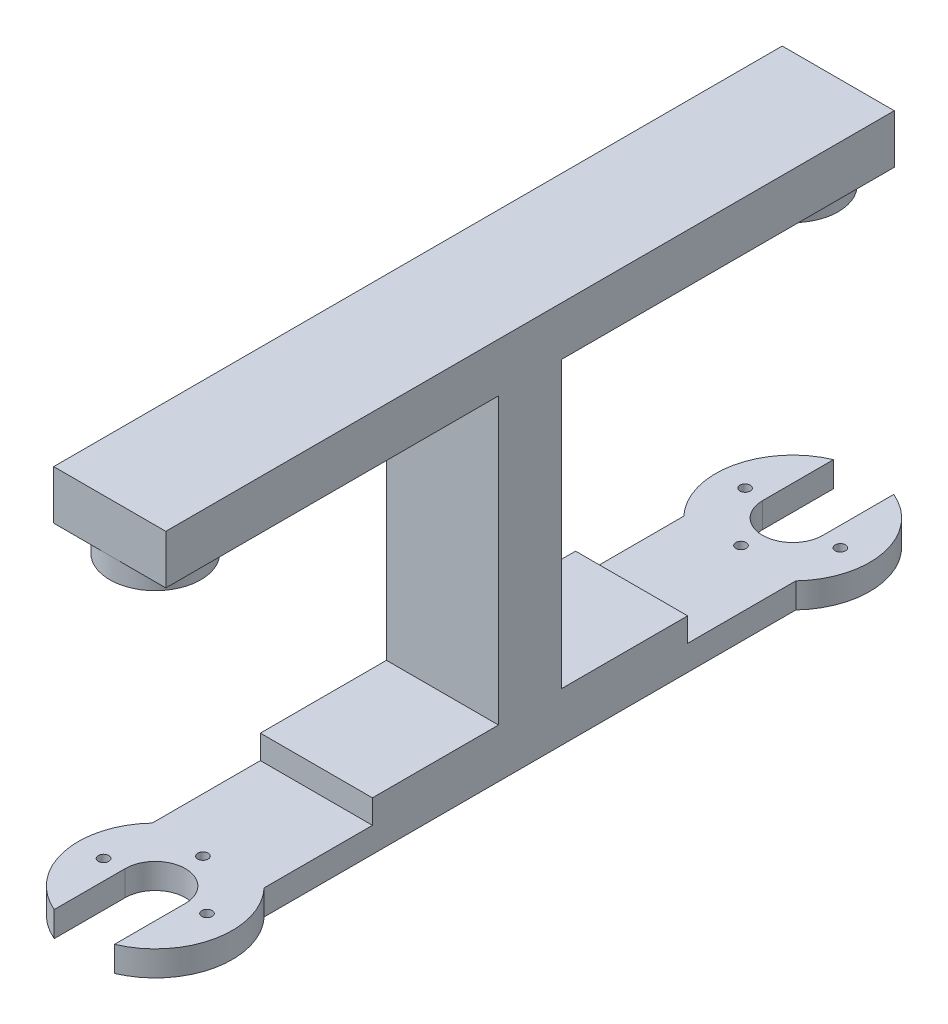
ISO-10303-21;
HEADER;
FILE_DESCRIPTION(('STEP AP214'),'2;1');
FILE_NAME('part.step','',(''),(''),'','','');
FILE_SCHEMA(('AUTOMOTIVE_DESIGN { 1 0 10303 214 1 1 1 1 }'));
ENDSEC;
DATA;
#1=APPLICATION_CONTEXT('core data for automotive mechanical design processes');
#2=APPLICATION_PROTOCOL_DEFINITION('international standard','automotive_design',2000,#1);
#3=PRODUCT_CONTEXT('',#1,'mechanical');
#4=PRODUCT('Part','Part','',(#3));
#5=PRODUCT_RELATED_PRODUCT_CATEGORY('part','',(#4));
#6=PRODUCT_DEFINITION_FORMATION('','',#4);
#7=PRODUCT_DEFINITION_CONTEXT('part definition',#1,'design');
#8=PRODUCT_DEFINITION('design','',#6,#7);
#9=PRODUCT_DEFINITION_SHAPE('','',#8);
#10=(LENGTH_UNIT() NAMED_UNIT(*) SI_UNIT(.MILLI.,.METRE.));
#11=(NAMED_UNIT(*) PLANE_ANGLE_UNIT() SI_UNIT($,.RADIAN.));
#12=(NAMED_UNIT(*) SI_UNIT($,.STERADIAN.) SOLID_ANGLE_UNIT());
#13=UNCERTAINTY_MEASURE_WITH_UNIT(LENGTH_MEASURE(1.E-05),#10,'distance_accuracy_value','');
#14=(GEOMETRIC_REPRESENTATION_CONTEXT(3) GLOBAL_UNCERTAINTY_ASSIGNED_CONTEXT((#13)) GLOBAL_UNIT_ASSIGNED_CONTEXT((#10,
#11,#12)) REPRESENTATION_CONTEXT('',''));
#15=CARTESIAN_POINT('',(0.,0.,0.));
#16=DIRECTION('',(0.,0.,1.));
#17=DIRECTION('',(1.,0.,0.));
#18=AXIS2_PLACEMENT_3D('',#15,#16,#17);
#19=CARTESIAN_POINT('',(16.,0.,0.));
#20=DIRECTION('',(-1.,0.,0.));
#21=DIRECTION('',(0.,0.,1.));
#22=AXIS2_PLACEMENT_3D('',#19,#20,#21);
#23=PLANE('',#22);
#24=DIRECTION('',(0.,-1.,0.));
#25=VECTOR('',#24,1.);
#26=CARTESIAN_POINT('',(16.,0.,-74.5));
#27=LINE('',#26,#25);
#28=CARTESIAN_POINT('',(16.,-37.7,-74.5));
#29=VERTEX_POINT('',#28);
#30=CARTESIAN_POINT('',(16.,-41.1,-74.5));
#31=VERTEX_POINT('',#30);
#32=EDGE_CURVE('E835',#29,#31,#27,.T.);
#33=ORIENTED_EDGE('',*,*,#32,.F.);
#34=DIRECTION('',(0.,0.,-1.));
#35=VECTOR('',#34,1.);
#36=CARTESIAN_POINT('',(16.,-37.7,-56.5));
#37=LINE('',#36,#35);
#38=CARTESIAN_POINT('',(16.,-37.7,-56.5));
#39=VERTEX_POINT('',#38);
#40=EDGE_CURVE('E630',#39,#29,#37,.T.);
#41=ORIENTED_EDGE('',*,*,#40,.F.);
#42=DIRECTION('',(0.,-1.,0.));
#43=VECTOR('',#42,1.);
#44=CARTESIAN_POINT('',(16.,3.,-56.5));
#45=LINE('',#44,#43);
#46=CARTESIAN_POINT('',(16.,3.,-56.5));
#47=VERTEX_POINT('',#46);
#48=EDGE_CURVE('E634',#47,#39,#45,.T.);
#49=ORIENTED_EDGE('',*,*,#48,.F.);
#50=DIRECTION('',(0.,0.,1.));
#51=VECTOR('',#50,1.);
#52=CARTESIAN_POINT('',(16.,3.,-91.));
#53=LINE('',#52,#51);
#54=CARTESIAN_POINT('',(16.,3.,-104.));
#55=VERTEX_POINT('',#54);
#56=EDGE_CURVE('E637',#55,#47,#53,.T.);
#57=ORIENTED_EDGE('',*,*,#56,.F.);
#58=DIRECTION('',(0.,-1.,0.));
#59=VECTOR('',#58,1.);
#60=CARTESIAN_POINT('',(16.,0.,-104.));
#61=LINE('',#60,#59);
#62=CARTESIAN_POINT('',(16.,10.,-104.));
#63=VERTEX_POINT('',#62);
#64=EDGE_CURVE('E627',#63,#55,#61,.T.);
#65=ORIENTED_EDGE('',*,*,#64,.F.);
#66=DIRECTION('',(0.,0.,1.));
#67=VECTOR('',#66,1.);
#68=CARTESIAN_POINT('',(16.,10.,0.));
#69=LINE('',#68,#67);
#70=CARTESIAN_POINT('',(16.,10.,0.));
#71=VERTEX_POINT('',#70);
#72=EDGE_CURVE('E476',#63,#71,#69,.T.);
#73=ORIENTED_EDGE('',*,*,#72,.T.);
#74=DIRECTION('',(0.,-1.,0.));
#75=VECTOR('',#74,1.);
#76=CARTESIAN_POINT('',(16.,0.,0.));
#77=LINE('',#76,#75);
#78=CARTESIAN_POINT('',(16.,3.,0.));
#79=VERTEX_POINT('',#78);
#80=EDGE_CURVE('E481',#71,#79,#77,.T.);
#81=ORIENTED_EDGE('',*,*,#80,.T.);
#82=DIRECTION('',(0.,0.,-1.));
#83=VECTOR('',#82,1.);
#84=CARTESIAN_POINT('',(16.,3.,-13.));
#85=LINE('',#84,#83);
#86=CARTESIAN_POINT('',(16.,3.,-47.5));
#87=VERTEX_POINT('',#86);
#88=EDGE_CURVE('E503',#79,#87,#85,.T.);
#89=ORIENTED_EDGE('',*,*,#88,.T.);
#90=DIRECTION('',(0.,-1.,0.));
#91=VECTOR('',#90,1.);
#92=CARTESIAN_POINT('',(16.,3.,-47.5));
#93=LINE('',#92,#91);
#94=CARTESIAN_POINT('',(16.,-37.7,-47.5));
#95=VERTEX_POINT('',#94);
#96=EDGE_CURVE('E501',#87,#95,#93,.T.);
#97=ORIENTED_EDGE('',*,*,#96,.T.);
#98=DIRECTION('',(0.,0.,1.));
#99=VECTOR('',#98,1.);
#100=CARTESIAN_POINT('',(16.,-37.7,-47.5));
#101=LINE('',#100,#99);
#102=CARTESIAN_POINT('',(16.,-37.7,-29.5));
#103=VERTEX_POINT('',#102);
#104=EDGE_CURVE('E498',#95,#103,#101,.T.);
#105=ORIENTED_EDGE('',*,*,#104,.T.);
#106=DIRECTION('',(0.,-1.,0.));
#107=VECTOR('',#106,1.);
#108=CARTESIAN_POINT('',(16.,0.,-29.5));
#109=LINE('',#108,#107);
#110=CARTESIAN_POINT('',(16.,-41.1,-29.5));
#111=VERTEX_POINT('',#110);
#112=EDGE_CURVE('E590',#103,#111,#109,.T.);
#113=ORIENTED_EDGE('',*,*,#112,.T.);
#114=DIRECTION('',(0.,0.,-1.));
#115=VECTOR('',#114,1.);
#116=CARTESIAN_POINT('',(16.,-41.1,0.));
#117=LINE('',#116,#115);
#118=CARTESIAN_POINT('',(16.,-41.1,-14.0498344352708));
#119=VERTEX_POINT('',#118);
#120=EDGE_CURVE('E540',#119,#111,#117,.T.);
#121=ORIENTED_EDGE('',*,*,#120,.F.);
#122=DIRECTION('',(0.,-1.,0.));
#123=VECTOR('',#122,1.);
#124=CARTESIAN_POINT('',(16.,-37.7,-14.0498344352708));
#125=LINE('',#124,#123);
#126=CARTESIAN_POINT('',(16.,-44.7,-14.0498344352708));
#127=VERTEX_POINT('',#126);
#128=EDGE_CURVE('E517',#127,#119,#125,.F.);
#129=ORIENTED_EDGE('',*,*,#128,.F.);
#130=DIRECTION('',(0.,0.,-1.));
#131=VECTOR('',#130,1.);
#132=CARTESIAN_POINT('',(16.,-44.7,0.));
#133=LINE('',#132,#131);
#134=CARTESIAN_POINT('',(16.,-44.7,-89.9501655647292));
#135=VERTEX_POINT('',#134);
#136=EDGE_CURVE('E496',#127,#135,#133,.T.);
#137=ORIENTED_EDGE('',*,*,#136,.T.);
#138=DIRECTION('',(0.,-1.,0.));
#139=VECTOR('',#138,1.);
#140=CARTESIAN_POINT('',(16.,-37.7,-89.9501655647292));
#141=LINE('',#140,#139);
#142=CARTESIAN_POINT('',(16.,-41.1,-89.9501655647292));
#143=VERTEX_POINT('',#142);
#144=EDGE_CURVE('E610',#135,#143,#141,.F.);
#145=ORIENTED_EDGE('',*,*,#144,.T.);
#146=DIRECTION('',(0.,0.,1.));
#147=VECTOR('',#146,1.);
#148=CARTESIAN_POINT('',(16.,-41.1,0.));
#149=LINE('',#148,#147);
#150=EDGE_CURVE('E829',#143,#31,#149,.T.);
#151=ORIENTED_EDGE('',*,*,#150,.T.);
#152=EDGE_LOOP('',(#33,#41,#49,#57,#65,#73,#81,#89,#97,#105,#113,#121,#129,#137,#145,#151));
#153=FACE_BOUND('',#152,.T.);
#154=ADVANCED_FACE('F226',(#153),#23,.F.);
#155=CARTESIAN_POINT('',(0.,0.,0.));
#156=DIRECTION('',(-1.,0.,0.));
#157=DIRECTION('',(0.,0.,1.));
#158=AXIS2_PLACEMENT_3D('',#155,#156,#157);
#159=PLANE('',#158);
#160=DIRECTION('',(0.,0.,-1.));
#161=VECTOR('',#160,1.);
#162=CARTESIAN_POINT('',(0.,-37.7,-56.5));
#163=LINE('',#162,#161);
#164=CARTESIAN_POINT('',(0.,-37.7,-56.5));
#165=VERTEX_POINT('',#164);
#166=CARTESIAN_POINT('',(0.,-37.7,-74.5));
#167=VERTEX_POINT('',#166);
#168=EDGE_CURVE('E643',#165,#167,#163,.T.);
#169=ORIENTED_EDGE('',*,*,#168,.T.);
#170=DIRECTION('',(0.,-1.,0.));
#171=VECTOR('',#170,1.);
#172=CARTESIAN_POINT('',(0.,0.,-74.5));
#173=LINE('',#172,#171);
#174=CARTESIAN_POINT('',(0.,-41.1,-74.5));
#175=VERTEX_POINT('',#174);
#176=EDGE_CURVE('E832',#167,#175,#173,.T.);
#177=ORIENTED_EDGE('',*,*,#176,.T.);
#178=DIRECTION('',(0.,0.,1.));
#179=VECTOR('',#178,1.);
#180=CARTESIAN_POINT('',(0.,-41.1,0.));
#181=LINE('',#180,#179);
#182=CARTESIAN_POINT('',(0.,-41.1,-89.9501655647292));
#183=VERTEX_POINT('',#182);
#184=EDGE_CURVE('E413',#183,#175,#181,.T.);
#185=ORIENTED_EDGE('',*,*,#184,.F.);
#186=DIRECTION('',(0.,-1.,0.));
#187=VECTOR('',#186,1.);
#188=CARTESIAN_POINT('',(0.,-37.7,-89.9501655647292));
#189=LINE('',#188,#187);
#190=CARTESIAN_POINT('',(0.,-44.7,-89.9501655647292));
#191=VERTEX_POINT('',#190);
#192=EDGE_CURVE('E412',#191,#183,#189,.F.);
#193=ORIENTED_EDGE('',*,*,#192,.F.);
#194=DIRECTION('',(0.,0.,-1.));
#195=VECTOR('',#194,1.);
#196=CARTESIAN_POINT('',(0.,-44.7,0.));
#197=LINE('',#196,#195);
#198=CARTESIAN_POINT('',(0.,-44.7,-14.0498344352708));
#199=VERTEX_POINT('',#198);
#200=EDGE_CURVE('E482',#199,#191,#197,.T.);
#201=ORIENTED_EDGE('',*,*,#200,.F.);
#202=DIRECTION('',(0.,-1.,0.));
#203=VECTOR('',#202,1.);
#204=CARTESIAN_POINT('',(0.,-37.7,-14.0498344352707));
#205=LINE('',#204,#203);
#206=CARTESIAN_POINT('',(0.,-41.1,-14.0498344352708));
#207=VERTEX_POINT('',#206);
#208=EDGE_CURVE('E520',#199,#207,#205,.F.);
#209=ORIENTED_EDGE('',*,*,#208,.T.);
#210=DIRECTION('',(0.,0.,-1.));
#211=VECTOR('',#210,1.);
#212=CARTESIAN_POINT('',(0.,-41.1,0.));
#213=LINE('',#212,#211);
#214=CARTESIAN_POINT('',(0.,-41.1,-29.5));
#215=VERTEX_POINT('',#214);
#216=EDGE_CURVE('E587',#207,#215,#213,.T.);
#217=ORIENTED_EDGE('',*,*,#216,.T.);
#218=DIRECTION('',(0.,-1.,0.));
#219=VECTOR('',#218,1.);
#220=CARTESIAN_POINT('',(0.,0.,-29.5));
#221=LINE('',#220,#219);
#222=CARTESIAN_POINT('',(0.,-37.7,-29.5));
#223=VERTEX_POINT('',#222);
#224=EDGE_CURVE('E236',#223,#215,#221,.T.);
#225=ORIENTED_EDGE('',*,*,#224,.F.);
#226=DIRECTION('',(0.,0.,1.));
#227=VECTOR('',#226,1.);
#228=CARTESIAN_POINT('',(0.,-37.7,-47.5));
#229=LINE('',#228,#227);
#230=CARTESIAN_POINT('',(0.,-37.7,-47.5));
#231=VERTEX_POINT('',#230);
#232=EDGE_CURVE('E485',#231,#223,#229,.T.);
#233=ORIENTED_EDGE('',*,*,#232,.F.);
#234=DIRECTION('',(0.,-1.,0.));
#235=VECTOR('',#234,1.);
#236=CARTESIAN_POINT('',(0.,3.,-47.5));
#237=LINE('',#236,#235);
#238=CARTESIAN_POINT('',(0.,3.,-47.5));
#239=VERTEX_POINT('',#238);
#240=EDGE_CURVE('E487',#239,#231,#237,.T.);
#241=ORIENTED_EDGE('',*,*,#240,.F.);
#242=DIRECTION('',(0.,0.,-1.));
#243=VECTOR('',#242,1.);
#244=CARTESIAN_POINT('',(0.,3.,-13.));
#245=LINE('',#244,#243);
#246=CARTESIAN_POINT('',(0.,3.,0.));
#247=VERTEX_POINT('',#246);
#248=EDGE_CURVE('E489',#247,#239,#245,.T.);
#249=ORIENTED_EDGE('',*,*,#248,.F.);
#250=DIRECTION('',(0.,-1.,0.));
#251=VECTOR('',#250,1.);
#252=CARTESIAN_POINT('',(0.,0.,0.));
#253=LINE('',#252,#251);
#254=CARTESIAN_POINT('',(0.,10.,0.));
#255=VERTEX_POINT('',#254);
#256=EDGE_CURVE('E491',#255,#247,#253,.T.);
#257=ORIENTED_EDGE('',*,*,#256,.F.);
#258=DIRECTION('',(0.,0.,1.));
#259=VECTOR('',#258,1.);
#260=CARTESIAN_POINT('',(0.,10.,0.));
#261=LINE('',#260,#259);
#262=CARTESIAN_POINT('',(0.,10.,-104.));
#263=VERTEX_POINT('',#262);
#264=EDGE_CURVE('E479',#263,#255,#261,.T.);
#265=ORIENTED_EDGE('',*,*,#264,.F.);
#266=DIRECTION('',(0.,-1.,0.));
#267=VECTOR('',#266,1.);
#268=CARTESIAN_POINT('',(0.,0.,-104.));
#269=LINE('',#268,#267);
#270=CARTESIAN_POINT('',(0.,3.,-104.));
#271=VERTEX_POINT('',#270);
#272=EDGE_CURVE('E624',#263,#271,#269,.T.);
#273=ORIENTED_EDGE('',*,*,#272,.T.);
#274=DIRECTION('',(0.,0.,1.));
#275=VECTOR('',#274,1.);
#276=CARTESIAN_POINT('',(0.,3.,-91.));
#277=LINE('',#276,#275);
#278=CARTESIAN_POINT('',(0.,3.,-56.5));
#279=VERTEX_POINT('',#278);
#280=EDGE_CURVE('E631',#271,#279,#277,.T.);
#281=ORIENTED_EDGE('',*,*,#280,.T.);
#282=DIRECTION('',(0.,-1.,0.));
#283=VECTOR('',#282,1.);
#284=CARTESIAN_POINT('',(0.,3.,-56.5));
#285=LINE('',#284,#283);
#286=EDGE_CURVE('E645',#279,#165,#285,.T.);
#287=ORIENTED_EDGE('',*,*,#286,.T.);
#288=EDGE_LOOP('',(#169,#177,#185,#193,#201,#209,#217,#225,#233,#241,#249,#257,#265,#273,#281,#287));
#289=FACE_BOUND('',#288,.T.);
#290=ADVANCED_FACE('F607',(#289),#159,.T.);
#291=CARTESIAN_POINT('',(16.,-37.7,-56.5));
#292=DIRECTION('',(0.,1.,0.));
#293=DIRECTION('',(0.,0.,1.));
#294=AXIS2_PLACEMENT_3D('',#291,#292,#293);
#295=PLANE('',#294);
#296=ORIENTED_EDGE('',*,*,#40,.T.);
#297=DIRECTION('',(-1.,0.,0.));
#298=VECTOR('',#297,1.);
#299=CARTESIAN_POINT('',(25.,-37.7,-74.5));
#300=LINE('',#299,#298);
#301=EDGE_CURVE('E821',#29,#167,#300,.T.);
#302=ORIENTED_EDGE('',*,*,#301,.T.);
#303=ORIENTED_EDGE('',*,*,#168,.F.);
#304=DIRECTION('',(-1.,0.,0.));
#305=VECTOR('',#304,1.);
#306=CARTESIAN_POINT('',(16.,-37.7,-56.5));
#307=LINE('',#306,#305);
#308=EDGE_CURVE('E651',#39,#165,#307,.T.);
#309=ORIENTED_EDGE('',*,*,#308,.F.);
#310=EDGE_LOOP('',(#296,#302,#303,#309));
#311=FACE_BOUND('',#310,.T.);
#312=ADVANCED_FACE('F681',(#311),#295,.T.);
#313=CARTESIAN_POINT('',(8.,-37.7,-97.5));
#314=DIRECTION('',(0.,-1.,0.));
#315=DIRECTION('',(0.,0.,-1.));
#316=AXIS2_PLACEMENT_3D('',#313,#314,#315);
#317=CYLINDRICAL_SURFACE('',#316,11.);
#318=CARTESIAN_POINT('',(8.,-41.1,-97.5));
#319=DIRECTION('',(0.,-1.,0.));
#320=DIRECTION('',(0.,0.,-1.));
#321=AXIS2_PLACEMENT_3D('',#318,#319,#320);
#322=CIRCLE('',#321,11.);
#323=CARTESIAN_POINT('',(12.3,-41.1,-107.624722218412));
#324=VERTEX_POINT('',#323);
#325=EDGE_CURVE('E243',#143,#324,#322,.F.);
#326=ORIENTED_EDGE('',*,*,#325,.F.);
#327=ORIENTED_EDGE('',*,*,#144,.F.);
#328=CARTESIAN_POINT('',(8.,-44.7,-97.5));
#329=DIRECTION('',(0.,-1.,0.));
#330=DIRECTION('',(0.,0.,-1.));
#331=AXIS2_PLACEMENT_3D('',#328,#329,#330);
#332=CIRCLE('',#331,11.);
#333=CARTESIAN_POINT('',(12.3,-44.7,-107.624722218412));
#334=VERTEX_POINT('',#333);
#335=EDGE_CURVE('E251',#334,#135,#332,.T.);
#336=ORIENTED_EDGE('',*,*,#335,.F.);
#337=DIRECTION('',(0.,-1.,0.));
#338=VECTOR('',#337,1.);
#339=CARTESIAN_POINT('',(12.3,-37.7,-107.624722218412));
#340=LINE('',#339,#338);
#341=EDGE_CURVE('E419',#324,#334,#340,.T.);
#342=ORIENTED_EDGE('',*,*,#341,.F.);
#343=EDGE_LOOP('',(#326,#327,#336,#342));
#344=FACE_BOUND('',#343,.T.);
#345=ADVANCED_FACE('F740',(#344),#317,.T.);
#346=CARTESIAN_POINT('',(16.,0.,-104.));
#347=DIRECTION('',(0.,0.,-1.));
#348=DIRECTION('',(-1.,0.,0.));
#349=AXIS2_PLACEMENT_3D('',#346,#347,#348);
#350=PLANE('',#349);
#351=ORIENTED_EDGE('',*,*,#64,.T.);
#352=DIRECTION('',(-1.,0.,0.));
#353=VECTOR('',#352,1.);
#354=CARTESIAN_POINT('',(0.,3.,-104.));
#355=LINE('',#354,#353);
#356=CARTESIAN_POINT('',(8.,3.,-104.));
#357=VERTEX_POINT('',#356);
#358=EDGE_CURVE('E615',#55,#357,#355,.T.);
#359=ORIENTED_EDGE('',*,*,#358,.T.);
#360=DIRECTION('',(-1.,0.,0.));
#361=VECTOR('',#360,1.);
#362=CARTESIAN_POINT('',(0.,3.,-104.));
#363=LINE('',#362,#361);
#364=EDGE_CURVE('E621',#357,#271,#363,.T.);
#365=ORIENTED_EDGE('',*,*,#364,.T.);
#366=ORIENTED_EDGE('',*,*,#272,.F.);
#367=DIRECTION('',(-1.,0.,0.));
#368=VECTOR('',#367,1.);
#369=CARTESIAN_POINT('',(16.,10.,-104.));
#370=LINE('',#369,#368);
#371=EDGE_CURVE('E567',#63,#263,#370,.T.);
#372=ORIENTED_EDGE('',*,*,#371,.F.);
#373=EDGE_LOOP('',(#351,#359,#365,#366,#372));
#374=FACE_BOUND('',#373,.T.);
#375=ADVANCED_FACE('F735',(#374),#350,.T.);
#376=CARTESIAN_POINT('',(8.,-37.7,-6.5));
#377=DIRECTION('',(0.,-1.,0.));
#378=DIRECTION('',(0.,0.,-1.));
#379=AXIS2_PLACEMENT_3D('',#376,#377,#378);
#380=CYLINDRICAL_SURFACE('',#379,11.);
#381=CARTESIAN_POINT('',(8.,-41.1,-6.5));
#382=DIRECTION('',(0.,1.,0.));
#383=DIRECTION('',(0.,0.,1.));
#384=AXIS2_PLACEMENT_3D('',#381,#382,#383);
#385=CIRCLE('',#384,11.);
#386=CARTESIAN_POINT('',(3.7,-41.1,3.62472221841172));
#387=VERTEX_POINT('',#386);
#388=EDGE_CURVE('E585',#207,#387,#385,.T.);
#389=ORIENTED_EDGE('',*,*,#388,.F.);
#390=ORIENTED_EDGE('',*,*,#208,.F.);
#391=CARTESIAN_POINT('',(8.,-44.7,-6.5));
#392=DIRECTION('',(0.,1.,0.));
#393=DIRECTION('',(0.,0.,1.));
#394=AXIS2_PLACEMENT_3D('',#391,#392,#393);
#395=CIRCLE('',#394,11.);
#396=CARTESIAN_POINT('',(3.70000000000001,-44.7,3.62472221841172));
#397=VERTEX_POINT('',#396);
#398=EDGE_CURVE('E523',#199,#397,#395,.T.);
#399=ORIENTED_EDGE('',*,*,#398,.T.);
#400=DIRECTION('',(0.,-1.,0.));
#401=VECTOR('',#400,1.);
#402=CARTESIAN_POINT('',(3.70000000000001,-37.7,3.62472221841172));
#403=LINE('',#402,#401);
#404=EDGE_CURVE('E436',#387,#397,#403,.T.);
#405=ORIENTED_EDGE('',*,*,#404,.F.);
#406=EDGE_LOOP('',(#389,#390,#399,#405));
#407=FACE_BOUND('',#406,.T.);
#408=ADVANCED_FACE('F604',(#407),#380,.T.);
#409=CARTESIAN_POINT('',(8.,-41.1,-6.5));
#410=DIRECTION('',(0.,1.,0.));
#411=DIRECTION('',(0.,0.,1.));
#412=AXIS2_PLACEMENT_3D('',#409,#410,#411);
#413=CIRCLE('',#412,11.);
#414=CARTESIAN_POINT('',(12.3,-41.1,3.62472221841172));
#415=VERTEX_POINT('',#414);
#416=EDGE_CURVE('E579',#415,#119,#413,.T.);
#417=ORIENTED_EDGE('',*,*,#416,.F.);
#418=DIRECTION('',(0.,-1.,0.));
#419=VECTOR('',#418,1.);
#420=CARTESIAN_POINT('',(12.3,-37.7,3.62472221841172));
#421=LINE('',#420,#419);
#422=CARTESIAN_POINT('',(12.3,-44.7,3.62472221841172));
#423=VERTEX_POINT('',#422);
#424=EDGE_CURVE('E440',#415,#423,#421,.T.);
#425=ORIENTED_EDGE('',*,*,#424,.T.);
#426=EDGE_CURVE('E525',#423,#127,#395,.T.);
#427=ORIENTED_EDGE('',*,*,#426,.T.);
#428=ORIENTED_EDGE('',*,*,#128,.T.);
#429=EDGE_LOOP('',(#417,#425,#427,#428));
#430=FACE_BOUND('',#429,.T.);
#431=ADVANCED_FACE('F533',(#430),#380,.T.);
#432=CARTESIAN_POINT('',(8.,-37.7,-6.5));
#433=DIRECTION('',(0.,-1.,0.));
#434=DIRECTION('',(0.,0.,-1.));
#435=AXIS2_PLACEMENT_3D('',#432,#433,#434);
#436=CYLINDRICAL_SURFACE('',#435,4.3);
#437=DIRECTION('',(0.,-1.,0.));
#438=VECTOR('',#437,1.);
#439=CARTESIAN_POINT('',(12.3,-37.7,-6.5));
#440=LINE('',#439,#438);
#441=CARTESIAN_POINT('',(12.3,-41.1,-6.5));
#442=VERTEX_POINT('',#441);
#443=CARTESIAN_POINT('',(12.3,-44.7,-6.5));
#444=VERTEX_POINT('',#443);
#445=EDGE_CURVE('E457',#442,#444,#440,.T.);
#446=ORIENTED_EDGE('',*,*,#445,.F.);
#447=CARTESIAN_POINT('',(8.,-41.1,-6.5));
#448=DIRECTION('',(0.,1.,0.));
#449=DIRECTION('',(0.,0.,1.));
#450=AXIS2_PLACEMENT_3D('',#447,#448,#449);
#451=CIRCLE('',#450,4.3);
#452=CARTESIAN_POINT('',(3.7,-41.1,-6.5));
#453=VERTEX_POINT('',#452);
#454=EDGE_CURVE('E574',#442,#453,#451,.T.);
#455=ORIENTED_EDGE('',*,*,#454,.T.);
#456=DIRECTION('',(0.,-1.,0.));
#457=VECTOR('',#456,1.);
#458=CARTESIAN_POINT('',(3.7,-37.7,-6.5));
#459=LINE('',#458,#457);
#460=CARTESIAN_POINT('',(3.7,-44.7,-6.5));
#461=VERTEX_POINT('',#460);
#462=EDGE_CURVE('E441',#453,#461,#459,.T.);
#463=ORIENTED_EDGE('',*,*,#462,.T.);
#464=CARTESIAN_POINT('',(8.,-44.7,-6.5));
#465=DIRECTION('',(0.,1.,0.));
#466=DIRECTION('',(0.,0.,1.));
#467=AXIS2_PLACEMENT_3D('',#464,#465,#466);
#468=CIRCLE('',#467,4.3);
#469=EDGE_CURVE('E592',#444,#461,#468,.T.);
#470=ORIENTED_EDGE('',*,*,#469,.F.);
#471=EDGE_LOOP('',(#446,#455,#463,#470));
#472=FACE_BOUND('',#471,.T.);
#473=ADVANCED_FACE('F724',(#472),#436,.F.);
#474=CARTESIAN_POINT('',(3.7,-37.7,-6.5));
#475=DIRECTION('',(1.,0.,0.));
#476=DIRECTION('',(0.,0.,-1.));
#477=AXIS2_PLACEMENT_3D('',#474,#475,#476);
#478=PLANE('',#477);
#479=ORIENTED_EDGE('',*,*,#462,.F.);
#480=DIRECTION('',(0.,0.,1.));
#481=VECTOR('',#480,1.);
#482=CARTESIAN_POINT('',(3.7,-41.1,-6.5));
#483=LINE('',#482,#481);
#484=EDGE_CURVE('E582',#453,#387,#483,.T.);
#485=ORIENTED_EDGE('',*,*,#484,.T.);
#486=ORIENTED_EDGE('',*,*,#404,.T.);
#487=DIRECTION('',(0.,0.,1.));
#488=VECTOR('',#487,1.);
#489=CARTESIAN_POINT('',(3.7,-44.7,-6.5));
#490=LINE('',#489,#488);
#491=EDGE_CURVE('E458',#461,#397,#490,.T.);
#492=ORIENTED_EDGE('',*,*,#491,.F.);
#493=EDGE_LOOP('',(#479,#485,#486,#492));
#494=FACE_BOUND('',#493,.T.);
#495=ADVANCED_FACE('F725',(#494),#478,.T.);
#496=CARTESIAN_POINT('',(12.3,-37.7,-6.5));
#497=DIRECTION('',(1.,0.,0.));
#498=DIRECTION('',(0.,0.,-1.));
#499=AXIS2_PLACEMENT_3D('',#496,#497,#498);
#500=PLANE('',#499);
#501=DIRECTION('',(0.,0.,1.));
#502=VECTOR('',#501,1.);
#503=CARTESIAN_POINT('',(12.3,-41.1,-6.5));
#504=LINE('',#503,#502);
#505=EDGE_CURVE('E435',#442,#415,#504,.T.);
#506=ORIENTED_EDGE('',*,*,#505,.F.);
#507=ORIENTED_EDGE('',*,*,#445,.T.);
#508=DIRECTION('',(0.,0.,1.));
#509=VECTOR('',#508,1.);
#510=CARTESIAN_POINT('',(12.3,-44.7,-6.5));
#511=LINE('',#510,#509);
#512=EDGE_CURVE('E439',#444,#423,#511,.T.);
#513=ORIENTED_EDGE('',*,*,#512,.T.);
#514=ORIENTED_EDGE('',*,*,#424,.F.);
#515=EDGE_LOOP('',(#506,#507,#513,#514));
#516=FACE_BOUND('',#515,.T.);
#517=ADVANCED_FACE('F694',(#516),#500,.F.);
#518=CARTESIAN_POINT('',(16.,-37.7,-47.5));
#519=DIRECTION('',(0.,-1.,0.));
#520=DIRECTION('',(0.,0.,-1.));
#521=AXIS2_PLACEMENT_3D('',#518,#519,#520);
#522=PLANE('',#521);
#523=ORIENTED_EDGE('',*,*,#232,.T.);
#524=DIRECTION('',(-1.,0.,0.));
#525=VECTOR('',#524,1.);
#526=CARTESIAN_POINT('',(25.,-37.7,-29.5));
#527=LINE('',#526,#525);
#528=EDGE_CURVE('E575',#103,#223,#527,.T.);
#529=ORIENTED_EDGE('',*,*,#528,.F.);
#530=ORIENTED_EDGE('',*,*,#104,.F.);
#531=DIRECTION('',(-1.,0.,0.));
#532=VECTOR('',#531,1.);
#533=CARTESIAN_POINT('',(16.,-37.7,-47.5));
#534=LINE('',#533,#532);
#535=EDGE_CURVE('E463',#95,#231,#534,.T.);
#536=ORIENTED_EDGE('',*,*,#535,.T.);
#537=EDGE_LOOP('',(#523,#529,#530,#536));
#538=FACE_BOUND('',#537,.T.);
#539=ADVANCED_FACE('F546',(#538),#522,.F.);
#540=CARTESIAN_POINT('',(16.,-44.7,0.));
#541=DIRECTION('',(0.,1.,0.));
#542=DIRECTION('',(0.,0.,1.));
#543=AXIS2_PLACEMENT_3D('',#540,#541,#542);
#544=PLANE('',#543);
#545=CARTESIAN_POINT('',(0.905981389684534,-44.7,-97.7913759710372));
#546=DIRECTION('',(0.,1.,0.));
#547=DIRECTION('',(0.,0.,1.));
#548=AXIS2_PLACEMENT_3D('',#545,#546,#547);
#549=CIRCLE('',#548,0.74);
#550=CARTESIAN_POINT('',(0.905981389684534,-44.7,-97.0513759710372));
#551=VERTEX_POINT('',#550);
#552=EDGE_CURVE('E801',#551,#551,#549,.T.);
#553=ORIENTED_EDGE('',*,*,#552,.T.);
#554=EDGE_LOOP('',(#553));
#555=FACE_BOUND('',#554,.T.);
#556=CARTESIAN_POINT('',(7.70862402896281,-44.7,-90.4059813896845));
#557=DIRECTION('',(0.,1.,0.));
#558=DIRECTION('',(0.,0.,1.));
#559=AXIS2_PLACEMENT_3D('',#556,#557,#558);
#560=CIRCLE('',#559,0.740000000000001);
#561=CARTESIAN_POINT('',(7.70862402896281,-44.7,-89.6659813896845));
#562=VERTEX_POINT('',#561);
#563=EDGE_CURVE('E805',#562,#562,#560,.T.);
#564=ORIENTED_EDGE('',*,*,#563,.T.);
#565=EDGE_LOOP('',(#564));
#566=FACE_BOUND('',#565,.T.);
#567=CARTESIAN_POINT('',(15.0940186103155,-44.7,-97.2086240289628));
#568=DIRECTION('',(0.,1.,0.));
#569=DIRECTION('',(0.,0.,1.));
#570=AXIS2_PLACEMENT_3D('',#567,#568,#569);
#571=CIRCLE('',#570,0.740000000000002);
#572=CARTESIAN_POINT('',(15.0940186103155,-44.7,-96.4686240289628));
#573=VERTEX_POINT('',#572);
#574=EDGE_CURVE('E815',#573,#573,#571,.T.);
#575=ORIENTED_EDGE('',*,*,#574,.T.);
#576=EDGE_LOOP('',(#575));
#577=FACE_BOUND('',#576,.T.);
#578=CARTESIAN_POINT('',(3.7,-44.7,-107.624722218412));
#579=VERTEX_POINT('',#578);
#580=EDGE_CURVE('E543',#191,#579,#332,.T.);
#581=ORIENTED_EDGE('',*,*,#580,.T.);
#582=DIRECTION('',(0.,0.,-1.));
#583=VECTOR('',#582,1.);
#584=CARTESIAN_POINT('',(3.7,-44.7,-97.5));
#585=LINE('',#584,#583);
#586=CARTESIAN_POINT('',(3.7,-44.7,-97.5));
#587=VERTEX_POINT('',#586);
#588=EDGE_CURVE('E417',#587,#579,#585,.T.);
#589=ORIENTED_EDGE('',*,*,#588,.F.);
#590=CARTESIAN_POINT('',(8.,-44.7,-97.5));
#591=DIRECTION('',(0.,1.,0.));
#592=DIRECTION('',(0.,0.,1.));
#593=AXIS2_PLACEMENT_3D('',#590,#591,#592);
#594=CIRCLE('',#593,4.3);
#595=CARTESIAN_POINT('',(12.3,-44.7,-97.5));
#596=VERTEX_POINT('',#595);
#597=EDGE_CURVE('E422',#596,#587,#594,.F.);
#598=ORIENTED_EDGE('',*,*,#597,.F.);
#599=DIRECTION('',(0.,0.,-1.));
#600=VECTOR('',#599,1.);
#601=CARTESIAN_POINT('',(12.3,-44.7,-97.5));
#602=LINE('',#601,#600);
#603=EDGE_CURVE('E612',#596,#334,#602,.T.);
#604=ORIENTED_EDGE('',*,*,#603,.T.);
#605=ORIENTED_EDGE('',*,*,#335,.T.);
#606=ORIENTED_EDGE('',*,*,#136,.F.);
#607=ORIENTED_EDGE('',*,*,#426,.F.);
#608=ORIENTED_EDGE('',*,*,#512,.F.);
#609=ORIENTED_EDGE('',*,*,#469,.T.);
#610=ORIENTED_EDGE('',*,*,#491,.T.);
#611=ORIENTED_EDGE('',*,*,#398,.F.);
#612=ORIENTED_EDGE('',*,*,#200,.T.);
#613=EDGE_LOOP('',(#581,#589,#598,#604,#605,#606,#607,#608,#609,#610,#611,#612));
#614=FACE_BOUND('',#613,.T.);
#615=CARTESIAN_POINT('',(0.905981389684534,-44.7,-6.20862402896281));
#616=DIRECTION('',(0.,-1.,0.));
#617=DIRECTION('',(0.,0.,-1.));
#618=AXIS2_PLACEMENT_3D('',#615,#616,#617);
#619=CIRCLE('',#618,0.74);
#620=CARTESIAN_POINT('',(0.905981389684534,-44.7,-6.94862402896281));
#621=VERTEX_POINT('',#620);
#622=EDGE_CURVE('E552',#621,#621,#619,.T.);
#623=ORIENTED_EDGE('',*,*,#622,.F.);
#624=EDGE_LOOP('',(#623));
#625=FACE_BOUND('',#624,.T.);
#626=CARTESIAN_POINT('',(7.70862402896281,-44.7,-13.5940186103155));
#627=DIRECTION('',(0.,-1.,0.));
#628=DIRECTION('',(0.,0.,-1.));
#629=AXIS2_PLACEMENT_3D('',#626,#627,#628);
#630=CIRCLE('',#629,0.740000000000001);
#631=CARTESIAN_POINT('',(7.70862402896281,-44.7,-14.3340186103155));
#632=VERTEX_POINT('',#631);
#633=EDGE_CURVE('E556',#632,#632,#630,.T.);
#634=ORIENTED_EDGE('',*,*,#633,.F.);
#635=EDGE_LOOP('',(#634));
#636=FACE_BOUND('',#635,.T.);
#637=CARTESIAN_POINT('',(15.0940186103155,-44.7,-6.79137597103718));
#638=DIRECTION('',(0.,-1.,0.));
#639=DIRECTION('',(0.,0.,-1.));
#640=AXIS2_PLACEMENT_3D('',#637,#638,#639);
#641=CIRCLE('',#640,0.740000000000002);
#642=CARTESIAN_POINT('',(15.0940186103155,-44.7,-7.53137597103718));
#643=VERTEX_POINT('',#642);
#644=EDGE_CURVE('E559',#643,#643,#641,.T.);
#645=ORIENTED_EDGE('',*,*,#644,.F.);
#646=EDGE_LOOP('',(#645));
#647=FACE_BOUND('',#646,.T.);
#648=ADVANCED_FACE('F541',(#555,#566,#577,#614,#625,#636,#647),#544,.F.);
#649=CARTESIAN_POINT('',(16.,0.,0.));
#650=DIRECTION('',(0.,1.,0.));
#651=DIRECTION('',(0.,0.,1.));
#652=AXIS2_PLACEMENT_3D('',#649,#650,#651);
#653=PLANE('',#652);
#654=CARTESIAN_POINT('',(8.,0.,-6.5));
#655=DIRECTION('',(0.,-1.,0.));
#656=DIRECTION('',(0.,0.,-1.));
#657=AXIS2_PLACEMENT_3D('',#654,#655,#656);
#658=CIRCLE('',#657,6.5);
#659=CARTESIAN_POINT('',(8.,0.,-13.));
#660=VERTEX_POINT('',#659);
#661=EDGE_CURVE('E507',#660,#660,#658,.T.);
#662=ORIENTED_EDGE('',*,*,#661,.T.);
#663=EDGE_LOOP('',(#662));
#664=FACE_BOUND('',#663,.T.);
#665=ADVANCED_FACE('F545',(#664),#653,.F.);
#666=CARTESIAN_POINT('',(16.,0.,0.));
#667=DIRECTION('',(0.,0.,-1.));
#668=DIRECTION('',(-1.,0.,0.));
#669=AXIS2_PLACEMENT_3D('',#666,#667,#668);
#670=PLANE('',#669);
#671=DIRECTION('',(-1.,0.,0.));
#672=VECTOR('',#671,1.);
#673=CARTESIAN_POINT('',(0.,3.,0.));
#674=LINE('',#673,#672);
#675=CARTESIAN_POINT('',(8.,3.,0.));
#676=VERTEX_POINT('',#675);
#677=EDGE_CURVE('E511',#79,#676,#674,.T.);
#678=ORIENTED_EDGE('',*,*,#677,.F.);
#679=ORIENTED_EDGE('',*,*,#80,.F.);
#680=DIRECTION('',(-1.,0.,0.));
#681=VECTOR('',#680,1.);
#682=CARTESIAN_POINT('',(16.,10.,0.));
#683=LINE('',#682,#681);
#684=EDGE_CURVE('E469',#71,#255,#683,.T.);
#685=ORIENTED_EDGE('',*,*,#684,.T.);
#686=ORIENTED_EDGE('',*,*,#256,.T.);
#687=DIRECTION('',(-1.,0.,0.));
#688=VECTOR('',#687,1.);
#689=CARTESIAN_POINT('',(0.,3.,0.));
#690=LINE('',#689,#688);
#691=EDGE_CURVE('E494',#676,#247,#690,.T.);
#692=ORIENTED_EDGE('',*,*,#691,.F.);
#693=EDGE_LOOP('',(#678,#679,#685,#686,#692));
#694=FACE_BOUND('',#693,.T.);
#695=ADVANCED_FACE('F228',(#694),#670,.F.);
#696=CARTESIAN_POINT('',(16.,3.,-13.));
#697=DIRECTION('',(0.,1.,0.));
#698=DIRECTION('',(0.,0.,1.));
#699=AXIS2_PLACEMENT_3D('',#696,#697,#698);
#700=PLANE('',#699);
#701=ORIENTED_EDGE('',*,*,#248,.T.);
#702=DIRECTION('',(-1.,0.,0.));
#703=VECTOR('',#702,1.);
#704=CARTESIAN_POINT('',(16.,3.,-47.5));
#705=LINE('',#704,#703);
#706=EDGE_CURVE('E455',#87,#239,#705,.T.);
#707=ORIENTED_EDGE('',*,*,#706,.F.);
#708=ORIENTED_EDGE('',*,*,#88,.F.);
#709=ORIENTED_EDGE('',*,*,#677,.T.);
#710=CARTESIAN_POINT('',(8.,3.,-6.5));
#711=DIRECTION('',(0.,-1.,0.));
#712=DIRECTION('',(0.,0.,-1.));
#713=AXIS2_PLACEMENT_3D('',#710,#711,#712);
#714=CIRCLE('',#713,6.5);
#715=EDGE_CURVE('E510',#676,#676,#714,.T.);
#716=ORIENTED_EDGE('',*,*,#715,.F.);
#717=ORIENTED_EDGE('',*,*,#691,.T.);
#718=EDGE_LOOP('',(#701,#707,#708,#709,#716,#717));
#719=FACE_BOUND('',#718,.T.);
#720=ADVANCED_FACE('F697',(#719),#700,.F.);
#721=CARTESIAN_POINT('',(16.,3.,-47.5));
#722=DIRECTION('',(0.,0.,-1.));
#723=DIRECTION('',(0.,1.,0.));
#724=AXIS2_PLACEMENT_3D('',#721,#722,#723);
#725=PLANE('',#724);
#726=ORIENTED_EDGE('',*,*,#240,.T.);
#727=ORIENTED_EDGE('',*,*,#535,.F.);
#728=ORIENTED_EDGE('',*,*,#96,.F.);
#729=ORIENTED_EDGE('',*,*,#706,.T.);
#730=EDGE_LOOP('',(#726,#727,#728,#729));
#731=FACE_BOUND('',#730,.T.);
#732=ADVANCED_FACE('F689',(#731),#725,.F.);
#733=CARTESIAN_POINT('',(16.,10.,0.));
#734=DIRECTION('',(0.,-1.,0.));
#735=DIRECTION('',(0.,0.,-1.));
#736=AXIS2_PLACEMENT_3D('',#733,#734,#735);
#737=PLANE('',#736);
#738=ORIENTED_EDGE('',*,*,#264,.T.);
#739=ORIENTED_EDGE('',*,*,#684,.F.);
#740=ORIENTED_EDGE('',*,*,#72,.F.);
#741=ORIENTED_EDGE('',*,*,#371,.T.);
#742=EDGE_LOOP('',(#738,#739,#740,#741));
#743=FACE_BOUND('',#742,.T.);
#744=ADVANCED_FACE('F687',(#743),#737,.F.);
#745=CARTESIAN_POINT('',(8.,3.,-6.5));
#746=DIRECTION('',(0.,-1.,0.));
#747=DIRECTION('',(0.,0.,-1.));
#748=AXIS2_PLACEMENT_3D('',#745,#746,#747);
#749=CYLINDRICAL_SURFACE('',#748,6.5);
#750=ORIENTED_EDGE('',*,*,#661,.F.);
#751=EDGE_LOOP('',(#750));
#752=FACE_BOUND('',#751,.T.);
#753=ORIENTED_EDGE('',*,*,#715,.T.);
#754=EDGE_LOOP('',(#753));
#755=FACE_BOUND('',#754,.T.);
#756=ADVANCED_FACE('F684',(#752,#755),#749,.T.);
#757=CARTESIAN_POINT('',(25.,0.,-29.5));
#758=DIRECTION('',(0.,0.,-1.));
#759=DIRECTION('',(0.,1.,0.));
#760=AXIS2_PLACEMENT_3D('',#757,#758,#759);
#761=PLANE('',#760);
#762=ORIENTED_EDGE('',*,*,#528,.T.);
#763=ORIENTED_EDGE('',*,*,#224,.T.);
#764=DIRECTION('',(-1.,0.,0.));
#765=VECTOR('',#764,1.);
#766=CARTESIAN_POINT('',(25.,-41.1,-29.5));
#767=LINE('',#766,#765);
#768=EDGE_CURVE('E571',#111,#215,#767,.T.);
#769=ORIENTED_EDGE('',*,*,#768,.F.);
#770=ORIENTED_EDGE('',*,*,#112,.F.);
#771=EDGE_LOOP('',(#762,#763,#769,#770));
#772=FACE_BOUND('',#771,.T.);
#773=ADVANCED_FACE('F710',(#772),#761,.F.);
#774=CARTESIAN_POINT('',(25.,-41.1,0.));
#775=DIRECTION('',(0.,1.,0.));
#776=DIRECTION('',(0.,0.,1.));
#777=AXIS2_PLACEMENT_3D('',#774,#775,#776);
#778=PLANE('',#777);
#779=CARTESIAN_POINT('',(0.905981389684534,-41.1,-6.20862402896281));
#780=DIRECTION('',(0.,1.,0.));
#781=DIRECTION('',(0.,0.,1.));
#782=AXIS2_PLACEMENT_3D('',#779,#780,#781);
#783=CIRCLE('',#782,0.74);
#784=CARTESIAN_POINT('',(0.905981389684534,-41.1,-5.46862402896281));
#785=VERTEX_POINT('',#784);
#786=EDGE_CURVE('E656',#785,#785,#783,.F.);
#787=ORIENTED_EDGE('',*,*,#786,.T.);
#788=EDGE_LOOP('',(#787));
#789=FACE_BOUND('',#788,.T.);
#790=CARTESIAN_POINT('',(7.70862402896281,-41.1,-13.5940186103155));
#791=DIRECTION('',(0.,1.,0.));
#792=DIRECTION('',(0.,0.,1.));
#793=AXIS2_PLACEMENT_3D('',#790,#791,#792);
#794=CIRCLE('',#793,0.740000000000001);
#795=CARTESIAN_POINT('',(7.70862402896281,-41.1,-12.8540186103155));
#796=VERTEX_POINT('',#795);
#797=EDGE_CURVE('E561',#796,#796,#794,.F.);
#798=ORIENTED_EDGE('',*,*,#797,.T.);
#799=EDGE_LOOP('',(#798));
#800=FACE_BOUND('',#799,.T.);
#801=CARTESIAN_POINT('',(15.0940186103155,-41.1,-6.79137597103718));
#802=DIRECTION('',(0.,1.,0.));
#803=DIRECTION('',(0.,0.,1.));
#804=AXIS2_PLACEMENT_3D('',#801,#802,#803);
#805=CIRCLE('',#804,0.740000000000002);
#806=CARTESIAN_POINT('',(15.0940186103155,-41.1,-6.05137597103717));
#807=VERTEX_POINT('',#806);
#808=EDGE_CURVE('E562',#807,#807,#805,.F.);
#809=ORIENTED_EDGE('',*,*,#808,.T.);
#810=EDGE_LOOP('',(#809));
#811=FACE_BOUND('',#810,.T.);
#812=ORIENTED_EDGE('',*,*,#388,.T.);
#813=ORIENTED_EDGE('',*,*,#484,.F.);
#814=ORIENTED_EDGE('',*,*,#454,.F.);
#815=ORIENTED_EDGE('',*,*,#505,.T.);
#816=ORIENTED_EDGE('',*,*,#416,.T.);
#817=ORIENTED_EDGE('',*,*,#120,.T.);
#818=ORIENTED_EDGE('',*,*,#768,.T.);
#819=ORIENTED_EDGE('',*,*,#216,.F.);
#820=EDGE_LOOP('',(#812,#813,#814,#815,#816,#817,#818,#819));
#821=FACE_BOUND('',#820,.T.);
#822=ADVANCED_FACE('F672',(#789,#800,#811,#821),#778,.T.);
#823=CARTESIAN_POINT('',(15.0940186103155,10.001,-6.79137597103718));
#824=DIRECTION('',(0.,-1.,0.));
#825=DIRECTION('',(0.,0.,-1.));
#826=AXIS2_PLACEMENT_3D('',#823,#824,#825);
#827=CYLINDRICAL_SURFACE('',#826,0.740000000000002);
#828=ORIENTED_EDGE('',*,*,#808,.F.);
#829=EDGE_LOOP('',(#828));
#830=FACE_BOUND('',#829,.T.);
#831=ORIENTED_EDGE('',*,*,#644,.T.);
#832=EDGE_LOOP('',(#831));
#833=FACE_BOUND('',#832,.T.);
#834=ADVANCED_FACE('F662',(#830,#833),#827,.F.);
#835=CARTESIAN_POINT('',(7.70862402896281,10.001,-13.5940186103155));
#836=DIRECTION('',(0.,-1.,0.));
#837=DIRECTION('',(0.,0.,-1.));
#838=AXIS2_PLACEMENT_3D('',#835,#836,#837);
#839=CYLINDRICAL_SURFACE('',#838,0.740000000000001);
#840=ORIENTED_EDGE('',*,*,#797,.F.);
#841=EDGE_LOOP('',(#840));
#842=FACE_BOUND('',#841,.T.);
#843=ORIENTED_EDGE('',*,*,#633,.T.);
#844=EDGE_LOOP('',(#843));
#845=FACE_BOUND('',#844,.T.);
#846=ADVANCED_FACE('F659',(#842,#845),#839,.F.);
#847=CARTESIAN_POINT('',(0.905981389684534,10.001,-6.20862402896281));
#848=DIRECTION('',(0.,-1.,0.));
#849=DIRECTION('',(0.,0.,-1.));
#850=AXIS2_PLACEMENT_3D('',#847,#848,#849);
#851=CYLINDRICAL_SURFACE('',#850,0.74);
#852=ORIENTED_EDGE('',*,*,#786,.F.);
#853=EDGE_LOOP('',(#852));
#854=FACE_BOUND('',#853,.T.);
#855=ORIENTED_EDGE('',*,*,#622,.T.);
#856=EDGE_LOOP('',(#855));
#857=FACE_BOUND('',#856,.T.);
#858=ADVANCED_FACE('F661',(#854,#857),#851,.F.);
#859=CARTESIAN_POINT('',(16.,3.,-56.5));
#860=DIRECTION('',(0.,0.,-1.));
#861=DIRECTION('',(0.,1.,0.));
#862=AXIS2_PLACEMENT_3D('',#859,#860,#861);
#863=PLANE('',#862);
#864=ORIENTED_EDGE('',*,*,#286,.F.);
#865=DIRECTION('',(-1.,0.,0.));
#866=VECTOR('',#865,1.);
#867=CARTESIAN_POINT('',(16.,3.,-56.5));
#868=LINE('',#867,#866);
#869=EDGE_CURVE('E640',#47,#279,#868,.T.);
#870=ORIENTED_EDGE('',*,*,#869,.F.);
#871=ORIENTED_EDGE('',*,*,#48,.T.);
#872=ORIENTED_EDGE('',*,*,#308,.T.);
#873=EDGE_LOOP('',(#864,#870,#871,#872));
#874=FACE_BOUND('',#873,.T.);
#875=ADVANCED_FACE('F669',(#874),#863,.T.);
#876=CARTESIAN_POINT('',(16.,3.,-91.));
#877=DIRECTION('',(0.,-1.,0.));
#878=DIRECTION('',(0.,0.,-1.));
#879=AXIS2_PLACEMENT_3D('',#876,#877,#878);
#880=PLANE('',#879);
#881=ORIENTED_EDGE('',*,*,#280,.F.);
#882=ORIENTED_EDGE('',*,*,#364,.F.);
#883=CARTESIAN_POINT('',(8.,3.,-97.5));
#884=DIRECTION('',(0.,1.,0.));
#885=DIRECTION('',(0.,0.,1.));
#886=AXIS2_PLACEMENT_3D('',#883,#884,#885);
#887=CIRCLE('',#886,6.5);
#888=EDGE_CURVE('E619',#357,#357,#887,.T.);
#889=ORIENTED_EDGE('',*,*,#888,.T.);
#890=ORIENTED_EDGE('',*,*,#358,.F.);
#891=ORIENTED_EDGE('',*,*,#56,.T.);
#892=ORIENTED_EDGE('',*,*,#869,.T.);
#893=EDGE_LOOP('',(#881,#882,#889,#890,#891,#892));
#894=FACE_BOUND('',#893,.T.);
#895=ADVANCED_FACE('F754',(#894),#880,.T.);
#896=CARTESIAN_POINT('',(16.,0.,-104.));
#897=DIRECTION('',(0.,-1.,0.));
#898=DIRECTION('',(0.,0.,-1.));
#899=AXIS2_PLACEMENT_3D('',#896,#897,#898);
#900=PLANE('',#899);
#901=CARTESIAN_POINT('',(8.,0.,-97.5));
#902=DIRECTION('',(0.,1.,0.));
#903=DIRECTION('',(0.,0.,1.));
#904=AXIS2_PLACEMENT_3D('',#901,#902,#903);
#905=CIRCLE('',#904,6.5);
#906=CARTESIAN_POINT('',(8.,0.,-91.));
#907=VERTEX_POINT('',#906);
#908=EDGE_CURVE('E618',#907,#907,#905,.T.);
#909=ORIENTED_EDGE('',*,*,#908,.F.);
#910=EDGE_LOOP('',(#909));
#911=FACE_BOUND('',#910,.T.);
#912=ADVANCED_FACE('F758',(#911),#900,.T.);
#913=CARTESIAN_POINT('',(8.,3.,-97.5));
#914=DIRECTION('',(0.,-1.,0.));
#915=DIRECTION('',(0.,0.,-1.));
#916=AXIS2_PLACEMENT_3D('',#913,#914,#915);
#917=CYLINDRICAL_SURFACE('',#916,6.5);
#918=ORIENTED_EDGE('',*,*,#908,.T.);
#919=EDGE_LOOP('',(#918));
#920=FACE_BOUND('',#919,.T.);
#921=ORIENTED_EDGE('',*,*,#888,.F.);
#922=EDGE_LOOP('',(#921));
#923=FACE_BOUND('',#922,.T.);
#924=ADVANCED_FACE('F762',(#920,#923),#917,.T.);
#925=CARTESIAN_POINT('',(8.,-41.1,-97.5));
#926=DIRECTION('',(0.,-1.,0.));
#927=DIRECTION('',(0.,0.,-1.));
#928=AXIS2_PLACEMENT_3D('',#925,#926,#927);
#929=CIRCLE('',#928,11.);
#930=CARTESIAN_POINT('',(3.7,-41.1,-107.624722218412));
#931=VERTEX_POINT('',#930);
#932=EDGE_CURVE('E398',#931,#183,#929,.F.);
#933=ORIENTED_EDGE('',*,*,#932,.F.);
#934=DIRECTION('',(0.,-1.,0.));
#935=VECTOR('',#934,1.);
#936=CARTESIAN_POINT('',(3.70000000000001,-37.7,-107.624722218412));
#937=LINE('',#936,#935);
#938=EDGE_CURVE('E410',#931,#579,#937,.T.);
#939=ORIENTED_EDGE('',*,*,#938,.T.);
#940=ORIENTED_EDGE('',*,*,#580,.F.);
#941=ORIENTED_EDGE('',*,*,#192,.T.);
#942=EDGE_LOOP('',(#933,#939,#940,#941));
#943=FACE_BOUND('',#942,.T.);
#944=ADVANCED_FACE('F408',(#943),#317,.T.);
#945=CARTESIAN_POINT('',(8.,-37.7,-97.5));
#946=DIRECTION('',(0.,-1.,0.));
#947=DIRECTION('',(0.,0.,-1.));
#948=AXIS2_PLACEMENT_3D('',#945,#946,#947);
#949=CYLINDRICAL_SURFACE('',#948,4.3);
#950=DIRECTION('',(0.,-1.,0.));
#951=VECTOR('',#950,1.);
#952=CARTESIAN_POINT('',(3.7,-37.7,-97.5));
#953=LINE('',#952,#951);
#954=CARTESIAN_POINT('',(3.7,-41.1,-97.5));
#955=VERTEX_POINT('',#954);
#956=EDGE_CURVE('E230',#955,#587,#953,.T.);
#957=ORIENTED_EDGE('',*,*,#956,.F.);
#958=CARTESIAN_POINT('',(8.,-41.1,-97.5));
#959=DIRECTION('',(0.,-1.,0.));
#960=DIRECTION('',(0.,0.,-1.));
#961=AXIS2_PLACEMENT_3D('',#958,#959,#960);
#962=CIRCLE('',#961,4.3);
#963=CARTESIAN_POINT('',(12.3,-41.1,-97.5));
#964=VERTEX_POINT('',#963);
#965=EDGE_CURVE('E401',#955,#964,#962,.F.);
#966=ORIENTED_EDGE('',*,*,#965,.T.);
#967=DIRECTION('',(0.,-1.,0.));
#968=VECTOR('',#967,1.);
#969=CARTESIAN_POINT('',(12.3,-37.7,-97.5));
#970=LINE('',#969,#968);
#971=EDGE_CURVE('E420',#964,#596,#970,.T.);
#972=ORIENTED_EDGE('',*,*,#971,.T.);
#973=ORIENTED_EDGE('',*,*,#597,.T.);
#974=EDGE_LOOP('',(#957,#966,#972,#973));
#975=FACE_BOUND('',#974,.T.);
#976=ADVANCED_FACE('F768',(#975),#949,.F.);
#977=CARTESIAN_POINT('',(3.7,-37.7,-97.5));
#978=DIRECTION('',(-1.,0.,0.));
#979=DIRECTION('',(0.,0.,1.));
#980=AXIS2_PLACEMENT_3D('',#977,#978,#979);
#981=PLANE('',#980);
#982=ORIENTED_EDGE('',*,*,#938,.F.);
#983=DIRECTION('',(0.,0.,1.));
#984=VECTOR('',#983,1.);
#985=CARTESIAN_POINT('',(3.7,-41.1,-97.5));
#986=LINE('',#985,#984);
#987=EDGE_CURVE('E395',#931,#955,#986,.T.);
#988=ORIENTED_EDGE('',*,*,#987,.T.);
#989=ORIENTED_EDGE('',*,*,#956,.T.);
#990=ORIENTED_EDGE('',*,*,#588,.T.);
#991=EDGE_LOOP('',(#982,#988,#989,#990));
#992=FACE_BOUND('',#991,.T.);
#993=ADVANCED_FACE('F415',(#992),#981,.F.);
#994=CARTESIAN_POINT('',(12.3,-37.7,-97.5));
#995=DIRECTION('',(-1.,0.,0.));
#996=DIRECTION('',(0.,0.,1.));
#997=AXIS2_PLACEMENT_3D('',#994,#995,#996);
#998=PLANE('',#997);
#999=DIRECTION('',(0.,0.,1.));
#1000=VECTOR('',#999,1.);
#1001=CARTESIAN_POINT('',(12.3,-41.1,-97.5));
#1002=LINE('',#1001,#1000);
#1003=EDGE_CURVE('E13',#324,#964,#1002,.T.);
#1004=ORIENTED_EDGE('',*,*,#1003,.F.);
#1005=ORIENTED_EDGE('',*,*,#341,.T.);
#1006=ORIENTED_EDGE('',*,*,#603,.F.);
#1007=ORIENTED_EDGE('',*,*,#971,.F.);
#1008=EDGE_LOOP('',(#1004,#1005,#1006,#1007));
#1009=FACE_BOUND('',#1008,.T.);
#1010=ADVANCED_FACE('F771',(#1009),#998,.T.);
#1011=CARTESIAN_POINT('',(25.,0.,-74.5));
#1012=DIRECTION('',(0.,0.,-1.));
#1013=DIRECTION('',(0.,1.,0.));
#1014=AXIS2_PLACEMENT_3D('',#1011,#1012,#1013);
#1015=PLANE('',#1014);
#1016=ORIENTED_EDGE('',*,*,#32,.T.);
#1017=DIRECTION('',(-1.,0.,0.));
#1018=VECTOR('',#1017,1.);
#1019=CARTESIAN_POINT('',(25.,-41.1,-74.5));
#1020=LINE('',#1019,#1018);
#1021=EDGE_CURVE('E807',#31,#175,#1020,.T.);
#1022=ORIENTED_EDGE('',*,*,#1021,.T.);
#1023=ORIENTED_EDGE('',*,*,#176,.F.);
#1024=ORIENTED_EDGE('',*,*,#301,.F.);
#1025=EDGE_LOOP('',(#1016,#1022,#1023,#1024));
#1026=FACE_BOUND('',#1025,.T.);
#1027=ADVANCED_FACE('F777',(#1026),#1015,.T.);
#1028=CARTESIAN_POINT('',(25.,-41.1,-104.));
#1029=DIRECTION('',(0.,-1.,0.));
#1030=DIRECTION('',(0.,0.,-1.));
#1031=AXIS2_PLACEMENT_3D('',#1028,#1029,#1030);
#1032=PLANE('',#1031);
#1033=CARTESIAN_POINT('',(0.905981389684534,-41.1,-97.7913759710372));
#1034=DIRECTION('',(0.,-1.,0.));
#1035=DIRECTION('',(0.,0.,-1.));
#1036=AXIS2_PLACEMENT_3D('',#1033,#1034,#1035);
#1037=CIRCLE('',#1036,0.74);
#1038=CARTESIAN_POINT('',(0.905981389684534,-41.1,-98.5313759710372));
#1039=VERTEX_POINT('',#1038);
#1040=EDGE_CURVE('E804',#1039,#1039,#1037,.T.);
#1041=ORIENTED_EDGE('',*,*,#1040,.T.);
#1042=EDGE_LOOP('',(#1041));
#1043=FACE_BOUND('',#1042,.T.);
#1044=CARTESIAN_POINT('',(7.70862402896281,-41.1,-90.4059813896845));
#1045=DIRECTION('',(0.,-1.,0.));
#1046=DIRECTION('',(0.,0.,-1.));
#1047=AXIS2_PLACEMENT_3D('',#1044,#1045,#1046);
#1048=CIRCLE('',#1047,0.740000000000001);
#1049=CARTESIAN_POINT('',(7.70862402896281,-41.1,-91.1459813896846));
#1050=VERTEX_POINT('',#1049);
#1051=EDGE_CURVE('E810',#1050,#1050,#1048,.T.);
#1052=ORIENTED_EDGE('',*,*,#1051,.T.);
#1053=EDGE_LOOP('',(#1052));
#1054=FACE_BOUND('',#1053,.T.);
#1055=CARTESIAN_POINT('',(15.0940186103155,-41.1,-97.2086240289628));
#1056=DIRECTION('',(0.,-1.,0.));
#1057=DIRECTION('',(0.,0.,-1.));
#1058=AXIS2_PLACEMENT_3D('',#1055,#1056,#1057);
#1059=CIRCLE('',#1058,0.740000000000002);
#1060=CARTESIAN_POINT('',(15.0940186103155,-41.1,-97.9486240289628));
#1061=VERTEX_POINT('',#1060);
#1062=EDGE_CURVE('E818',#1061,#1061,#1059,.T.);
#1063=ORIENTED_EDGE('',*,*,#1062,.T.);
#1064=EDGE_LOOP('',(#1063));
#1065=FACE_BOUND('',#1064,.T.);
#1066=ORIENTED_EDGE('',*,*,#325,.T.);
#1067=ORIENTED_EDGE('',*,*,#1003,.T.);
#1068=ORIENTED_EDGE('',*,*,#965,.F.);
#1069=ORIENTED_EDGE('',*,*,#987,.F.);
#1070=ORIENTED_EDGE('',*,*,#932,.T.);
#1071=ORIENTED_EDGE('',*,*,#184,.T.);
#1072=ORIENTED_EDGE('',*,*,#1021,.F.);
#1073=ORIENTED_EDGE('',*,*,#150,.F.);
#1074=EDGE_LOOP('',(#1066,#1067,#1068,#1069,#1070,#1071,#1072,#1073));
#1075=FACE_BOUND('',#1074,.T.);
#1076=ADVANCED_FACE('F397',(#1043,#1054,#1065,#1075),#1032,.F.);
#1077=CARTESIAN_POINT('',(15.0940186103155,10.001,-97.2086240289628));
#1078=DIRECTION('',(0.,-1.,0.));
#1079=DIRECTION('',(0.,0.,-1.));
#1080=AXIS2_PLACEMENT_3D('',#1077,#1078,#1079);
#1081=CYLINDRICAL_SURFACE('',#1080,0.740000000000002);
#1082=ORIENTED_EDGE('',*,*,#574,.F.);
#1083=EDGE_LOOP('',(#1082));
#1084=FACE_BOUND('',#1083,.T.);
#1085=ORIENTED_EDGE('',*,*,#1062,.F.);
#1086=EDGE_LOOP('',(#1085));
#1087=FACE_BOUND('',#1086,.T.);
#1088=ADVANCED_FACE('F781',(#1084,#1087),#1081,.F.);
#1089=CARTESIAN_POINT('',(7.70862402896281,10.001,-90.4059813896845));
#1090=DIRECTION('',(0.,-1.,0.));
#1091=DIRECTION('',(0.,0.,-1.));
#1092=AXIS2_PLACEMENT_3D('',#1089,#1090,#1091);
#1093=CYLINDRICAL_SURFACE('',#1092,0.740000000000001);
#1094=ORIENTED_EDGE('',*,*,#563,.F.);
#1095=EDGE_LOOP('',(#1094));
#1096=FACE_BOUND('',#1095,.T.);
#1097=ORIENTED_EDGE('',*,*,#1051,.F.);
#1098=EDGE_LOOP('',(#1097));
#1099=FACE_BOUND('',#1098,.T.);
#1100=ADVANCED_FACE('F788',(#1096,#1099),#1093,.F.);
#1101=CARTESIAN_POINT('',(0.905981389684534,10.001,-97.7913759710372));
#1102=DIRECTION('',(0.,-1.,0.));
#1103=DIRECTION('',(0.,0.,-1.));
#1104=AXIS2_PLACEMENT_3D('',#1101,#1102,#1103);
#1105=CYLINDRICAL_SURFACE('',#1104,0.74);
#1106=ORIENTED_EDGE('',*,*,#552,.F.);
#1107=EDGE_LOOP('',(#1106));
#1108=FACE_BOUND('',#1107,.T.);
#1109=ORIENTED_EDGE('',*,*,#1040,.F.);
#1110=EDGE_LOOP('',(#1109));
#1111=FACE_BOUND('',#1110,.T.);
#1112=ADVANCED_FACE('F792',(#1108,#1111),#1105,.F.);
#1113=CLOSED_SHELL('',(#154,#290,#312,#345,#375,#408,#431,#473,#495,#517,#539,#648,#665,#695,
#720,#732,#744,#756,#773,#822,#834,#846,#858,#875,#895,#912,#924,#944,#976,#993,#1010,#1027,
#1076,#1088,#1100,#1112));
#1114=MANIFOLD_SOLID_BREP('B2',#1113);
#1115=ADVANCED_BREP_SHAPE_REPRESENTATION('',(#18,#1114),#14);
#1116=SHAPE_DEFINITION_REPRESENTATION(#9,#1115);
ENDSEC;
END-ISO-10303-21;
